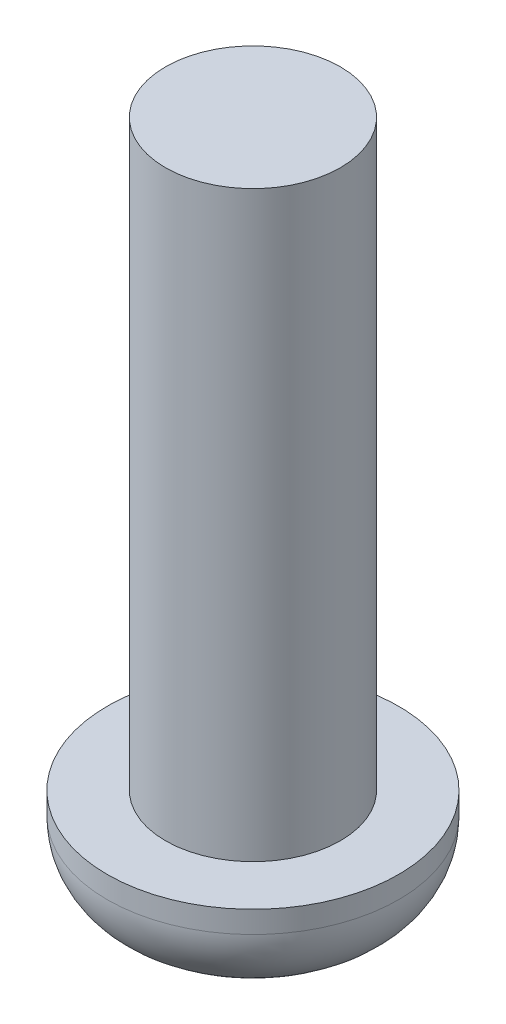
ISO-10303-21;
HEADER;
FILE_DESCRIPTION(('STEP AP214'),'2;1');
FILE_NAME('part.step','',(''),(''),'','','');
FILE_SCHEMA(('AUTOMOTIVE_DESIGN { 1 0 10303 214 1 1 1 1 }'));
ENDSEC;
DATA;
#1=APPLICATION_CONTEXT('core data for automotive mechanical design processes');
#2=APPLICATION_PROTOCOL_DEFINITION('international standard','automotive_design',2000,#1);
#3=PRODUCT_CONTEXT('',#1,'mechanical');
#4=PRODUCT('Part','Part','',(#3));
#5=PRODUCT_RELATED_PRODUCT_CATEGORY('part','',(#4));
#6=PRODUCT_DEFINITION_FORMATION('','',#4);
#7=PRODUCT_DEFINITION_CONTEXT('part definition',#1,'design');
#8=PRODUCT_DEFINITION('design','',#6,#7);
#9=PRODUCT_DEFINITION_SHAPE('','',#8);
#10=(LENGTH_UNIT() NAMED_UNIT(*) SI_UNIT(.MILLI.,.METRE.));
#11=(NAMED_UNIT(*) PLANE_ANGLE_UNIT() SI_UNIT($,.RADIAN.));
#12=(NAMED_UNIT(*) SI_UNIT($,.STERADIAN.) SOLID_ANGLE_UNIT());
#13=UNCERTAINTY_MEASURE_WITH_UNIT(LENGTH_MEASURE(1.E-05),#10,'distance_accuracy_value','');
#14=(GEOMETRIC_REPRESENTATION_CONTEXT(3) GLOBAL_UNCERTAINTY_ASSIGNED_CONTEXT((#13)) GLOBAL_UNIT_ASSIGNED_CONTEXT((#10,
#11,#12)) REPRESENTATION_CONTEXT('',''));
#15=CARTESIAN_POINT('',(0.,0.,0.));
#16=DIRECTION('',(0.,0.,1.));
#17=DIRECTION('',(1.,0.,0.));
#18=AXIS2_PLACEMENT_3D('',#15,#16,#17);
#19=CARTESIAN_POINT('',(0.,2.6,0.));
#20=DIRECTION('',(0.,-1.,0.));
#21=DIRECTION('',(0.,0.,-1.));
#22=AXIS2_PLACEMENT_3D('',#19,#20,#21);
#23=CYLINDRICAL_SURFACE('',#22,4.);
#24=CARTESIAN_POINT('',(0.,2.,0.));
#25=DIRECTION('',(0.,1.,0.));
#26=DIRECTION('',(0.,0.,1.));
#27=AXIS2_PLACEMENT_3D('',#24,#25,#26);
#28=CIRCLE('',#27,4.);
#29=CARTESIAN_POINT('',(0.,2.,4.));
#30=VERTEX_POINT('',#29);
#31=EDGE_CURVE('E41',#30,#30,#28,.T.);
#32=ORIENTED_EDGE('',*,*,#31,.T.);
#33=EDGE_LOOP('',(#32));
#34=FACE_BOUND('',#33,.T.);
#35=CARTESIAN_POINT('',(0.,2.6,0.));
#36=DIRECTION('',(0.,1.,0.));
#37=DIRECTION('',(0.,0.,1.));
#38=AXIS2_PLACEMENT_3D('',#35,#36,#37);
#39=CIRCLE('',#38,4.);
#40=CARTESIAN_POINT('',(0.,2.6,4.));
#41=VERTEX_POINT('',#40);
#42=EDGE_CURVE('E49',#41,#41,#39,.T.);
#43=ORIENTED_EDGE('',*,*,#42,.F.);
#44=EDGE_LOOP('',(#43));
#45=FACE_BOUND('',#44,.T.);
#46=ADVANCED_FACE('F34',(#34,#45),#23,.T.);
#47=CARTESIAN_POINT('',(0.,2.6,0.));
#48=DIRECTION('',(0.,1.,0.));
#49=DIRECTION('',(0.,0.,1.));
#50=AXIS2_PLACEMENT_3D('',#47,#48,#49);
#51=PLANE('',#50);
#52=CARTESIAN_POINT('',(0.,2.6,0.));
#53=DIRECTION('',(0.,1.,0.));
#54=DIRECTION('',(0.,0.,1.));
#55=AXIS2_PLACEMENT_3D('',#52,#53,#54);
#56=CIRCLE('',#55,2.4);
#57=CARTESIAN_POINT('',(0.,2.6,2.4));
#58=VERTEX_POINT('',#57);
#59=EDGE_CURVE('E45',#58,#58,#56,.T.);
#60=ORIENTED_EDGE('',*,*,#59,.F.);
#61=EDGE_LOOP('',(#60));
#62=FACE_BOUND('',#61,.T.);
#63=ORIENTED_EDGE('',*,*,#42,.T.);
#64=EDGE_LOOP('',(#63));
#65=FACE_BOUND('',#64,.T.);
#66=ADVANCED_FACE('F67',(#62,#65),#51,.T.);
#67=CARTESIAN_POINT('',(0.,0.,0.));
#68=DIRECTION('',(0.,1.,0.));
#69=DIRECTION('',(0.,0.,1.));
#70=AXIS2_PLACEMENT_3D('',#67,#68,#69);
#71=PLANE('',#70);
#72=CARTESIAN_POINT('',(0.,0.,0.));
#73=DIRECTION('',(0.,1.,0.));
#74=DIRECTION('',(0.,0.,1.));
#75=AXIS2_PLACEMENT_3D('',#72,#73,#74);
#76=CIRCLE('',#75,2.);
#77=CARTESIAN_POINT('',(0.,0.,2.));
#78=VERTEX_POINT('',#77);
#79=EDGE_CURVE('E10',#78,#78,#76,.F.);
#80=ORIENTED_EDGE('',*,*,#79,.T.);
#81=EDGE_LOOP('',(#80));
#82=FACE_BOUND('',#81,.T.);
#83=ADVANCED_FACE('F63',(#82),#71,.F.);
#84=CARTESIAN_POINT('',(0.,18.6,0.));
#85=DIRECTION('',(0.,-1.,0.));
#86=DIRECTION('',(0.,0.,-1.));
#87=AXIS2_PLACEMENT_3D('',#84,#85,#86);
#88=CYLINDRICAL_SURFACE('',#87,2.4);
#89=CARTESIAN_POINT('',(0.,18.6,0.));
#90=DIRECTION('',(0.,1.,0.));
#91=DIRECTION('',(0.,0.,1.));
#92=AXIS2_PLACEMENT_3D('',#89,#90,#91);
#93=CIRCLE('',#92,2.4);
#94=CARTESIAN_POINT('',(0.,18.6,2.4));
#95=VERTEX_POINT('',#94);
#96=EDGE_CURVE('E53',#95,#95,#93,.T.);
#97=ORIENTED_EDGE('',*,*,#96,.F.);
#98=EDGE_LOOP('',(#97));
#99=FACE_BOUND('',#98,.T.);
#100=ORIENTED_EDGE('',*,*,#59,.T.);
#101=EDGE_LOOP('',(#100));
#102=FACE_BOUND('',#101,.T.);
#103=ADVANCED_FACE('F60',(#99,#102),#88,.T.);
#104=CARTESIAN_POINT('',(0.,18.6,0.));
#105=DIRECTION('',(0.,1.,0.));
#106=DIRECTION('',(0.,0.,1.));
#107=AXIS2_PLACEMENT_3D('',#104,#105,#106);
#108=PLANE('',#107);
#109=ORIENTED_EDGE('',*,*,#96,.T.);
#110=EDGE_LOOP('',(#109));
#111=FACE_BOUND('',#110,.T.);
#112=ADVANCED_FACE('F58',(#111),#108,.T.);
#113=CARTESIAN_POINT('',(0.,2.,0.));
#114=DIRECTION('',(0.,1.,0.));
#115=DIRECTION('',(0.,0.,1.));
#116=AXIS2_PLACEMENT_3D('',#113,#114,#115);
#117=DEGENERATE_TOROIDAL_SURFACE('',#116,2.,2.,.T.);
#118=ORIENTED_EDGE('',*,*,#79,.F.);
#119=EDGE_LOOP('',(#118));
#120=FACE_BOUND('',#119,.T.);
#121=ORIENTED_EDGE('',*,*,#31,.F.);
#122=EDGE_LOOP('',(#121));
#123=FACE_BOUND('',#122,.T.);
#124=ADVANCED_FACE('F36',(#120,#123),#117,.T.);
#125=CLOSED_SHELL('',(#46,#66,#83,#103,#112,#124));
#126=MANIFOLD_SOLID_BREP('B2',#125);
#127=ADVANCED_BREP_SHAPE_REPRESENTATION('',(#18,#126),#14);
#128=SHAPE_DEFINITION_REPRESENTATION(#9,#127);
ENDSEC;
END-ISO-10303-21;
